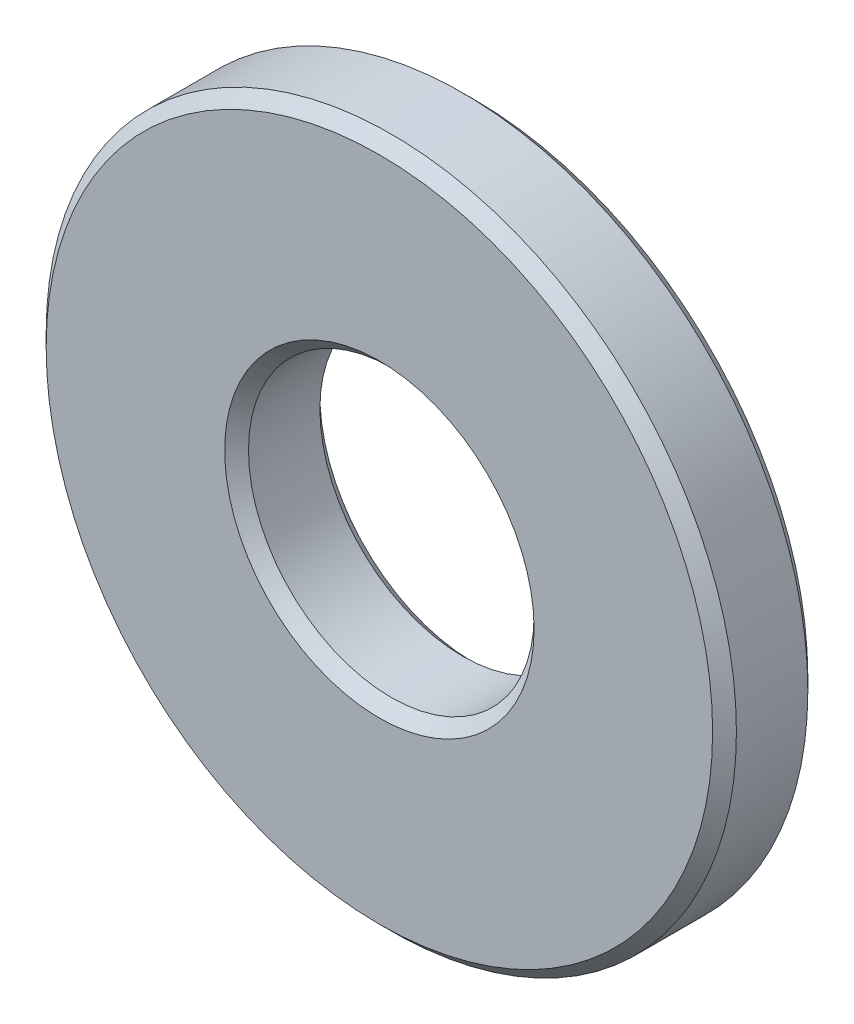
ISO-10303-21;
HEADER;
FILE_DESCRIPTION(('STEP AP214'),'2;1');
FILE_NAME('part.step','',(''),(''),'','','');
FILE_SCHEMA(('AUTOMOTIVE_DESIGN { 1 0 10303 214 1 1 1 1 }'));
ENDSEC;
DATA;
#1=APPLICATION_CONTEXT('core data for automotive mechanical design processes');
#2=APPLICATION_PROTOCOL_DEFINITION('international standard','automotive_design',2000,#1);
#3=PRODUCT_CONTEXT('',#1,'mechanical');
#4=PRODUCT('Part','Part','',(#3));
#5=PRODUCT_RELATED_PRODUCT_CATEGORY('part','',(#4));
#6=PRODUCT_DEFINITION_FORMATION('','',#4);
#7=PRODUCT_DEFINITION_CONTEXT('part definition',#1,'design');
#8=PRODUCT_DEFINITION('design','',#6,#7);
#9=PRODUCT_DEFINITION_SHAPE('','',#8);
#10=(LENGTH_UNIT() NAMED_UNIT(*) SI_UNIT(.MILLI.,.METRE.));
#11=(NAMED_UNIT(*) PLANE_ANGLE_UNIT() SI_UNIT($,.RADIAN.));
#12=(NAMED_UNIT(*) SI_UNIT($,.STERADIAN.) SOLID_ANGLE_UNIT());
#13=UNCERTAINTY_MEASURE_WITH_UNIT(LENGTH_MEASURE(1.E-05),#10,'distance_accuracy_value','');
#14=(GEOMETRIC_REPRESENTATION_CONTEXT(3) GLOBAL_UNCERTAINTY_ASSIGNED_CONTEXT((#13)) GLOBAL_UNIT_ASSIGNED_CONTEXT((#10,
#11,#12)) REPRESENTATION_CONTEXT('',''));
#15=CARTESIAN_POINT('',(0.,0.,0.));
#16=DIRECTION('',(0.,0.,1.));
#17=DIRECTION('',(1.,0.,0.));
#18=AXIS2_PLACEMENT_3D('',#15,#16,#17);
#19=CARTESIAN_POINT('',(0.,0.,8.));
#20=DIRECTION('',(0.,0.,1.));
#21=DIRECTION('',(1.,0.,0.));
#22=AXIS2_PLACEMENT_3D('',#19,#20,#21);
#23=PLANE('',#22);
#24=CARTESIAN_POINT('',(0.,0.,8.));
#25=DIRECTION('',(0.,0.,1.));
#26=DIRECTION('',(1.,0.,0.));
#27=AXIS2_PLACEMENT_3D('',#24,#25,#26);
#28=CIRCLE('',#27,28.);
#29=CARTESIAN_POINT('',(28.,0.,8.));
#30=VERTEX_POINT('',#29);
#31=EDGE_CURVE('E10',#30,#30,#28,.T.);
#32=ORIENTED_EDGE('',*,*,#31,.T.);
#33=EDGE_LOOP('',(#32));
#34=FACE_BOUND('',#33,.T.);
#35=CARTESIAN_POINT('',(0.,0.,8.));
#36=DIRECTION('',(0.,0.,1.));
#37=DIRECTION('',(1.,0.,0.));
#38=AXIS2_PLACEMENT_3D('',#35,#36,#37);
#39=CIRCLE('',#38,13.);
#40=CARTESIAN_POINT('',(13.,0.,8.));
#41=VERTEX_POINT('',#40);
#42=EDGE_CURVE('E59',#41,#41,#39,.F.);
#43=ORIENTED_EDGE('',*,*,#42,.T.);
#44=EDGE_LOOP('',(#43));
#45=FACE_BOUND('',#44,.T.);
#46=ADVANCED_FACE('F38',(#34,#45),#23,.T.);
#47=CARTESIAN_POINT('',(0.,0.,0.));
#48=DIRECTION('',(0.,0.,1.));
#49=DIRECTION('',(1.,0.,0.));
#50=AXIS2_PLACEMENT_3D('',#47,#48,#49);
#51=PLANE('',#50);
#52=CARTESIAN_POINT('',(0.,0.,0.));
#53=DIRECTION('',(0.,0.,1.));
#54=DIRECTION('',(1.,0.,0.));
#55=AXIS2_PLACEMENT_3D('',#52,#53,#54);
#56=CIRCLE('',#55,28.);
#57=CARTESIAN_POINT('',(28.,0.,0.));
#58=VERTEX_POINT('',#57);
#59=EDGE_CURVE('E46',#58,#58,#56,.F.);
#60=ORIENTED_EDGE('',*,*,#59,.T.);
#61=EDGE_LOOP('',(#60));
#62=FACE_BOUND('',#61,.T.);
#63=CARTESIAN_POINT('',(0.,0.,0.));
#64=DIRECTION('',(0.,0.,1.));
#65=DIRECTION('',(1.,0.,0.));
#66=AXIS2_PLACEMENT_3D('',#63,#64,#65);
#67=CIRCLE('',#66,13.);
#68=CARTESIAN_POINT('',(13.,0.,0.));
#69=VERTEX_POINT('',#68);
#70=EDGE_CURVE('E68',#69,#69,#67,.T.);
#71=ORIENTED_EDGE('',*,*,#70,.T.);
#72=EDGE_LOOP('',(#71));
#73=FACE_BOUND('',#72,.T.);
#74=ADVANCED_FACE('F72',(#62,#73),#51,.F.);
#75=CARTESIAN_POINT('',(0.,0.,8.));
#76=DIRECTION('',(0.,0.,-1.));
#77=DIRECTION('',(-1.,0.,0.));
#78=AXIS2_PLACEMENT_3D('',#75,#76,#77);
#79=CYLINDRICAL_SURFACE('',#78,29.);
#80=CARTESIAN_POINT('',(0.,0.,1.00000000000001));
#81=DIRECTION('',(0.,0.,1.));
#82=DIRECTION('',(1.,0.,0.));
#83=AXIS2_PLACEMENT_3D('',#80,#81,#82);
#84=CIRCLE('',#83,29.);
#85=CARTESIAN_POINT('',(29.,0.,1.00000000000001));
#86=VERTEX_POINT('',#85);
#87=EDGE_CURVE('E50',#86,#86,#84,.T.);
#88=ORIENTED_EDGE('',*,*,#87,.T.);
#89=EDGE_LOOP('',(#88));
#90=FACE_BOUND('',#89,.T.);
#91=CARTESIAN_POINT('',(0.,0.,7.));
#92=DIRECTION('',(0.,0.,1.));
#93=DIRECTION('',(1.,0.,0.));
#94=AXIS2_PLACEMENT_3D('',#91,#92,#93);
#95=CIRCLE('',#94,29.);
#96=CARTESIAN_POINT('',(29.,0.,7.));
#97=VERTEX_POINT('',#96);
#98=EDGE_CURVE('E54',#97,#97,#95,.F.);
#99=ORIENTED_EDGE('',*,*,#98,.T.);
#100=EDGE_LOOP('',(#99));
#101=FACE_BOUND('',#100,.T.);
#102=ADVANCED_FACE('F87',(#90,#101),#79,.T.);
#103=CARTESIAN_POINT('',(0.,0.,8.));
#104=DIRECTION('',(0.,0.,-1.));
#105=DIRECTION('',(-1.,0.,0.));
#106=AXIS2_PLACEMENT_3D('',#103,#104,#105);
#107=CYLINDRICAL_SURFACE('',#106,12.);
#108=CARTESIAN_POINT('',(0.,0.,1.));
#109=DIRECTION('',(0.,0.,1.));
#110=DIRECTION('',(1.,0.,0.));
#111=AXIS2_PLACEMENT_3D('',#108,#109,#110);
#112=CIRCLE('',#111,12.);
#113=CARTESIAN_POINT('',(12.,0.,1.));
#114=VERTEX_POINT('',#113);
#115=EDGE_CURVE('E62',#114,#114,#112,.F.);
#116=ORIENTED_EDGE('',*,*,#115,.T.);
#117=EDGE_LOOP('',(#116));
#118=FACE_BOUND('',#117,.T.);
#119=CARTESIAN_POINT('',(0.,0.,7.00000000000001));
#120=DIRECTION('',(0.,0.,1.));
#121=DIRECTION('',(1.,0.,0.));
#122=AXIS2_PLACEMENT_3D('',#119,#120,#121);
#123=CIRCLE('',#122,12.);
#124=CARTESIAN_POINT('',(12.,0.,7.00000000000001));
#125=VERTEX_POINT('',#124);
#126=EDGE_CURVE('E65',#125,#125,#123,.T.);
#127=ORIENTED_EDGE('',*,*,#126,.T.);
#128=EDGE_LOOP('',(#127));
#129=FACE_BOUND('',#128,.T.);
#130=ADVANCED_FACE('F77',(#118,#129),#107,.F.);
#131=CARTESIAN_POINT('',(0.,0.,0.));
#132=DIRECTION('',(0.,0.,-1.));
#133=DIRECTION('',(-1.,0.,0.));
#134=AXIS2_PLACEMENT_3D('',#131,#132,#133);
#135=CONICAL_SURFACE('',#134,13.,0.785398163397446);
#136=ORIENTED_EDGE('',*,*,#115,.F.);
#137=EDGE_LOOP('',(#136));
#138=FACE_BOUND('',#137,.T.);
#139=ORIENTED_EDGE('',*,*,#70,.F.);
#140=EDGE_LOOP('',(#139));
#141=FACE_BOUND('',#140,.T.);
#142=ADVANCED_FACE('F74',(#138,#141),#135,.F.);
#143=CARTESIAN_POINT('',(0.,0.,7.00000000000001));
#144=DIRECTION('',(0.,0.,1.));
#145=DIRECTION('',(1.,0.,0.));
#146=AXIS2_PLACEMENT_3D('',#143,#144,#145);
#147=CONICAL_SURFACE('',#146,12.,0.785398163397452);
#148=ORIENTED_EDGE('',*,*,#42,.F.);
#149=EDGE_LOOP('',(#148));
#150=FACE_BOUND('',#149,.T.);
#151=ORIENTED_EDGE('',*,*,#126,.F.);
#152=EDGE_LOOP('',(#151));
#153=FACE_BOUND('',#152,.T.);
#154=ADVANCED_FACE('F76',(#150,#153),#147,.F.);
#155=CARTESIAN_POINT('',(0.,0.,1.00000000000001));
#156=DIRECTION('',(0.,0.,1.));
#157=DIRECTION('',(1.,0.,0.));
#158=AXIS2_PLACEMENT_3D('',#155,#156,#157);
#159=CONICAL_SURFACE('',#158,29.,0.785398163397452);
#160=ORIENTED_EDGE('',*,*,#59,.F.);
#161=EDGE_LOOP('',(#160));
#162=FACE_BOUND('',#161,.T.);
#163=ORIENTED_EDGE('',*,*,#87,.F.);
#164=EDGE_LOOP('',(#163));
#165=FACE_BOUND('',#164,.T.);
#166=ADVANCED_FACE('F84',(#162,#165),#159,.T.);
#167=CARTESIAN_POINT('',(0.,0.,8.));
#168=DIRECTION('',(0.,0.,-1.));
#169=DIRECTION('',(-1.,0.,0.));
#170=AXIS2_PLACEMENT_3D('',#167,#168,#169);
#171=CONICAL_SURFACE('',#170,28.,0.785398163397448);
#172=ORIENTED_EDGE('',*,*,#98,.F.);
#173=EDGE_LOOP('',(#172));
#174=FACE_BOUND('',#173,.T.);
#175=ORIENTED_EDGE('',*,*,#31,.F.);
#176=EDGE_LOOP('',(#175));
#177=FACE_BOUND('',#176,.T.);
#178=ADVANCED_FACE('F41',(#174,#177),#171,.T.);
#179=CLOSED_SHELL('',(#46,#74,#102,#130,#142,#154,#166,#178));
#180=MANIFOLD_SOLID_BREP('B2',#179);
#181=ADVANCED_BREP_SHAPE_REPRESENTATION('',(#18,#180),#14);
#182=SHAPE_DEFINITION_REPRESENTATION(#9,#181);
ENDSEC;
END-ISO-10303-21;
